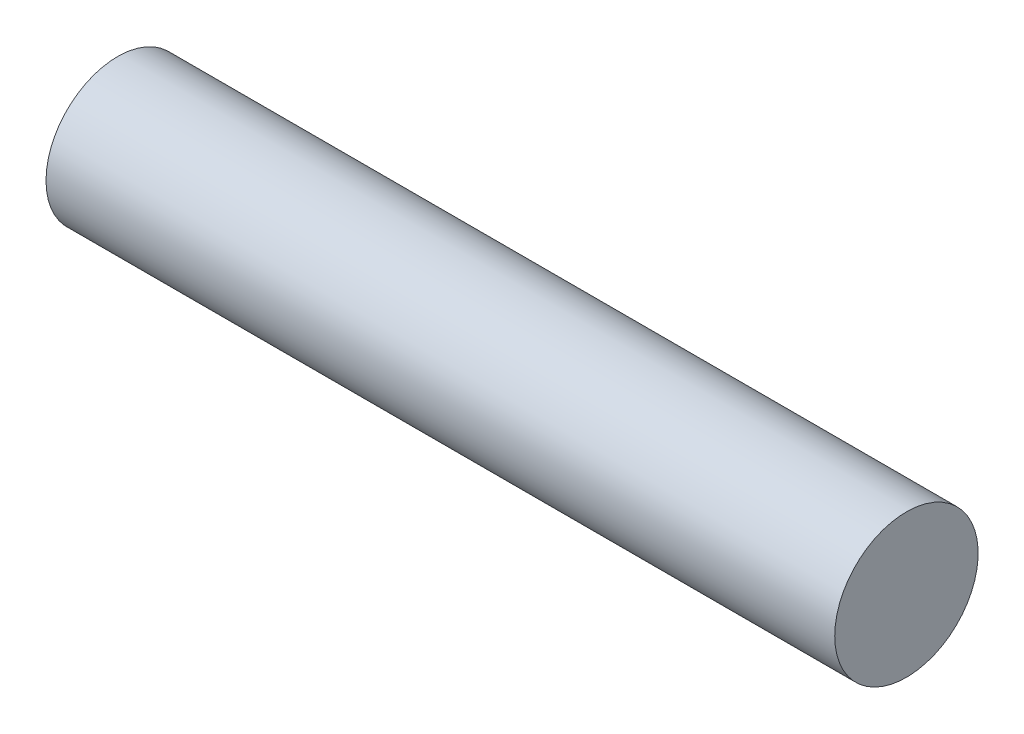
ISO-10303-21;
HEADER;
FILE_DESCRIPTION(('STEP AP214'),'2;1');
FILE_NAME('part.step','',(''),(''),'','','');
FILE_SCHEMA(('AUTOMOTIVE_DESIGN { 1 0 10303 214 1 1 1 1 }'));
ENDSEC;
DATA;
#1=APPLICATION_CONTEXT('core data for automotive mechanical design processes');
#2=APPLICATION_PROTOCOL_DEFINITION('international standard','automotive_design',2000,#1);
#3=PRODUCT_CONTEXT('',#1,'mechanical');
#4=PRODUCT('Part','Part','',(#3));
#5=PRODUCT_RELATED_PRODUCT_CATEGORY('part','',(#4));
#6=PRODUCT_DEFINITION_FORMATION('','',#4);
#7=PRODUCT_DEFINITION_CONTEXT('part definition',#1,'design');
#8=PRODUCT_DEFINITION('design','',#6,#7);
#9=PRODUCT_DEFINITION_SHAPE('','',#8);
#10=(LENGTH_UNIT() NAMED_UNIT(*) SI_UNIT(.MILLI.,.METRE.));
#11=(NAMED_UNIT(*) PLANE_ANGLE_UNIT() SI_UNIT($,.RADIAN.));
#12=(NAMED_UNIT(*) SI_UNIT($,.STERADIAN.) SOLID_ANGLE_UNIT());
#13=UNCERTAINTY_MEASURE_WITH_UNIT(LENGTH_MEASURE(1.E-05),#10,'distance_accuracy_value','');
#14=(GEOMETRIC_REPRESENTATION_CONTEXT(3) GLOBAL_UNCERTAINTY_ASSIGNED_CONTEXT((#13)) GLOBAL_UNIT_ASSIGNED_CONTEXT((#10,
#11,#12)) REPRESENTATION_CONTEXT('',''));
#15=CARTESIAN_POINT('',(0.,0.,0.));
#16=DIRECTION('',(0.,0.,1.));
#17=DIRECTION('',(1.,0.,0.));
#18=AXIS2_PLACEMENT_3D('',#15,#16,#17);
#19=CARTESIAN_POINT('',(22.,0.,0.));
#20=DIRECTION('',(-1.,0.,0.));
#21=DIRECTION('',(0.,0.,-1.));
#22=AXIS2_PLACEMENT_3D('',#19,#20,#21);
#23=CYLINDRICAL_SURFACE('',#22,2.);
#24=CARTESIAN_POINT('',(22.,0.,0.));
#25=DIRECTION('',(-1.,0.,0.));
#26=DIRECTION('',(0.,0.,1.));
#27=AXIS2_PLACEMENT_3D('',#24,#25,#26);
#28=CIRCLE('',#27,2.);
#29=CARTESIAN_POINT('',(22.,0.,2.));
#30=VERTEX_POINT('',#29);
#31=EDGE_CURVE('E10',#30,#30,#28,.T.);
#32=ORIENTED_EDGE('',*,*,#31,.T.);
#33=EDGE_LOOP('',(#32));
#34=FACE_BOUND('',#33,.T.);
#35=CARTESIAN_POINT('',(0.,0.,0.));
#36=DIRECTION('',(-1.,0.,0.));
#37=DIRECTION('',(0.,0.,1.));
#38=AXIS2_PLACEMENT_3D('',#35,#36,#37);
#39=CIRCLE('',#38,2.);
#40=CARTESIAN_POINT('',(0.,0.,2.));
#41=VERTEX_POINT('',#40);
#42=EDGE_CURVE('E38',#41,#41,#39,.T.);
#43=ORIENTED_EDGE('',*,*,#42,.F.);
#44=EDGE_LOOP('',(#43));
#45=FACE_BOUND('',#44,.T.);
#46=ADVANCED_FACE('F35',(#34,#45),#23,.T.);
#47=CARTESIAN_POINT('',(22.,0.,0.));
#48=DIRECTION('',(1.,0.,0.));
#49=DIRECTION('',(0.,0.,1.));
#50=AXIS2_PLACEMENT_3D('',#47,#48,#49);
#51=PLANE('',#50);
#52=ORIENTED_EDGE('',*,*,#31,.F.);
#53=EDGE_LOOP('',(#52));
#54=FACE_BOUND('',#53,.T.);
#55=ADVANCED_FACE('F50',(#54),#51,.T.);
#56=CARTESIAN_POINT('',(0.,0.,0.));
#57=DIRECTION('',(1.,0.,0.));
#58=DIRECTION('',(0.,0.,1.));
#59=AXIS2_PLACEMENT_3D('',#56,#57,#58);
#60=PLANE('',#59);
#61=ORIENTED_EDGE('',*,*,#42,.T.);
#62=EDGE_LOOP('',(#61));
#63=FACE_BOUND('',#62,.T.);
#64=ADVANCED_FACE('F47',(#63),#60,.F.);
#65=CLOSED_SHELL('',(#46,#55,#64));
#66=MANIFOLD_SOLID_BREP('B2',#65);
#67=ADVANCED_BREP_SHAPE_REPRESENTATION('',(#18,#66),#14);
#68=SHAPE_DEFINITION_REPRESENTATION(#9,#67);
ENDSEC;
END-ISO-10303-21;
